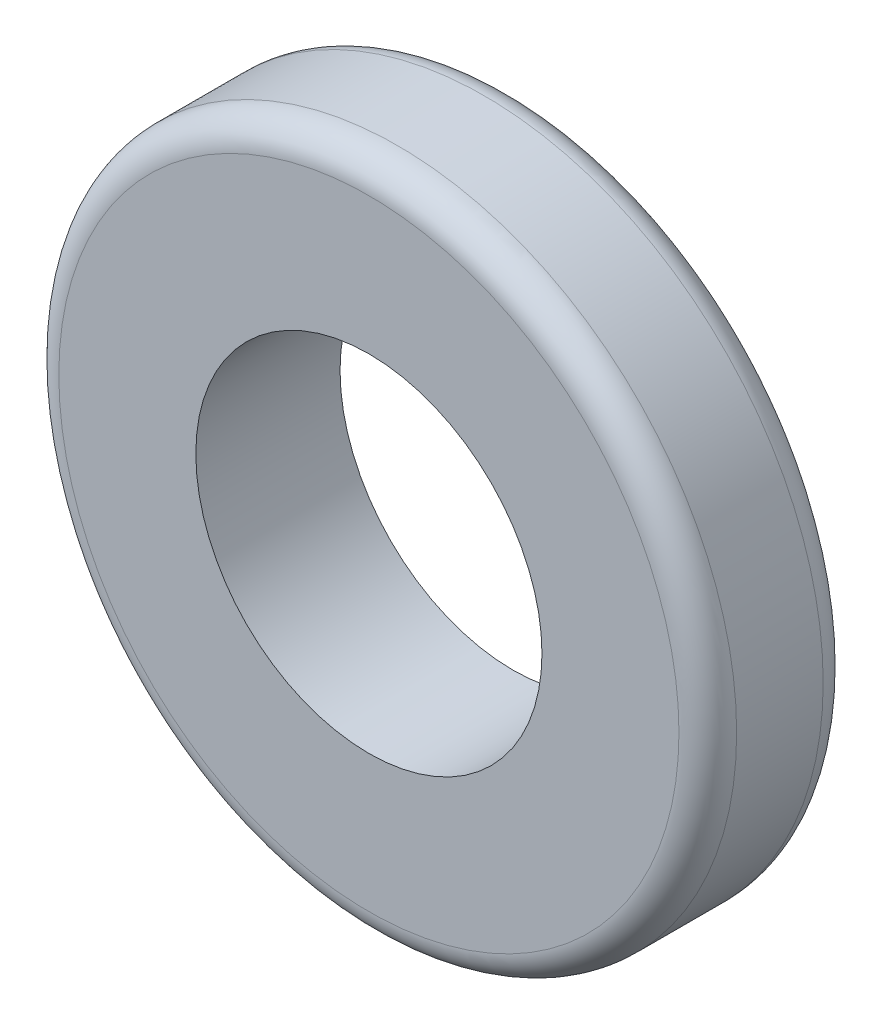
ISO-10303-21;
HEADER;
FILE_DESCRIPTION(('STEP AP214'),'2;1');
FILE_NAME('part.step','',(''),(''),'','','');
FILE_SCHEMA(('AUTOMOTIVE_DESIGN { 1 0 10303 214 1 1 1 1 }'));
ENDSEC;
DATA;
#1=APPLICATION_CONTEXT('core data for automotive mechanical design processes');
#2=APPLICATION_PROTOCOL_DEFINITION('international standard','automotive_design',2000,#1);
#3=PRODUCT_CONTEXT('',#1,'mechanical');
#4=PRODUCT('Part','Part','',(#3));
#5=PRODUCT_RELATED_PRODUCT_CATEGORY('part','',(#4));
#6=PRODUCT_DEFINITION_FORMATION('','',#4);
#7=PRODUCT_DEFINITION_CONTEXT('part definition',#1,'design');
#8=PRODUCT_DEFINITION('design','',#6,#7);
#9=PRODUCT_DEFINITION_SHAPE('','',#8);
#10=(LENGTH_UNIT() NAMED_UNIT(*) SI_UNIT(.MILLI.,.METRE.));
#11=(NAMED_UNIT(*) PLANE_ANGLE_UNIT() SI_UNIT($,.RADIAN.));
#12=(NAMED_UNIT(*) SI_UNIT($,.STERADIAN.) SOLID_ANGLE_UNIT());
#13=UNCERTAINTY_MEASURE_WITH_UNIT(LENGTH_MEASURE(1.E-05),#10,'distance_accuracy_value','');
#14=(GEOMETRIC_REPRESENTATION_CONTEXT(3) GLOBAL_UNCERTAINTY_ASSIGNED_CONTEXT((#13)) GLOBAL_UNIT_ASSIGNED_CONTEXT((#10,
#11,#12)) REPRESENTATION_CONTEXT('',''));
#15=CARTESIAN_POINT('',(0.,0.,0.));
#16=DIRECTION('',(0.,0.,1.));
#17=DIRECTION('',(1.,0.,0.));
#18=AXIS2_PLACEMENT_3D('',#15,#16,#17);
#19=CARTESIAN_POINT('',(0.,0.,10.));
#20=DIRECTION('',(0.,0.,1.));
#21=DIRECTION('',(1.,0.,0.));
#22=AXIS2_PLACEMENT_3D('',#19,#20,#21);
#23=PLANE('',#22);
#24=CARTESIAN_POINT('',(0.,0.,10.));
#25=DIRECTION('',(0.,0.,1.));
#26=DIRECTION('',(1.,0.,0.));
#27=AXIS2_PLACEMENT_3D('',#24,#25,#26);
#28=CIRCLE('',#27,21.5);
#29=CARTESIAN_POINT('',(21.5,0.,10.));
#30=VERTEX_POINT('',#29);
#31=EDGE_CURVE('E10',#30,#30,#28,.T.);
#32=ORIENTED_EDGE('',*,*,#31,.T.);
#33=EDGE_LOOP('',(#32));
#34=FACE_BOUND('',#33,.T.);
#35=CARTESIAN_POINT('',(0.,0.,10.));
#36=DIRECTION('',(0.,0.,1.));
#37=DIRECTION('',(1.,0.,0.));
#38=AXIS2_PLACEMENT_3D('',#35,#36,#37);
#39=CIRCLE('',#38,12.);
#40=CARTESIAN_POINT('',(12.,0.,10.));
#41=VERTEX_POINT('',#40);
#42=EDGE_CURVE('E51',#41,#41,#39,.T.);
#43=ORIENTED_EDGE('',*,*,#42,.F.);
#44=EDGE_LOOP('',(#43));
#45=FACE_BOUND('',#44,.T.);
#46=ADVANCED_FACE('F31',(#34,#45),#23,.T.);
#47=CARTESIAN_POINT('',(0.,0.,0.));
#48=DIRECTION('',(0.,0.,1.));
#49=DIRECTION('',(1.,0.,0.));
#50=AXIS2_PLACEMENT_3D('',#47,#48,#49);
#51=PLANE('',#50);
#52=CARTESIAN_POINT('',(0.,0.,0.));
#53=DIRECTION('',(0.,0.,1.));
#54=DIRECTION('',(1.,0.,0.));
#55=AXIS2_PLACEMENT_3D('',#52,#53,#54);
#56=CIRCLE('',#55,21.5);
#57=CARTESIAN_POINT('',(21.5,0.,0.));
#58=VERTEX_POINT('',#57);
#59=EDGE_CURVE('E38',#58,#58,#56,.F.);
#60=ORIENTED_EDGE('',*,*,#59,.T.);
#61=EDGE_LOOP('',(#60));
#62=FACE_BOUND('',#61,.T.);
#63=CARTESIAN_POINT('',(0.,0.,0.));
#64=DIRECTION('',(0.,0.,1.));
#65=DIRECTION('',(1.,0.,0.));
#66=AXIS2_PLACEMENT_3D('',#63,#64,#65);
#67=CIRCLE('',#66,12.);
#68=CARTESIAN_POINT('',(12.,0.,0.));
#69=VERTEX_POINT('',#68);
#70=EDGE_CURVE('E52',#69,#69,#67,.T.);
#71=ORIENTED_EDGE('',*,*,#70,.T.);
#72=EDGE_LOOP('',(#71));
#73=FACE_BOUND('',#72,.T.);
#74=ADVANCED_FACE('F62',(#62,#73),#51,.F.);
#75=CARTESIAN_POINT('',(0.,0.,10.));
#76=DIRECTION('',(0.,0.,-1.));
#77=DIRECTION('',(-1.,0.,0.));
#78=AXIS2_PLACEMENT_3D('',#75,#76,#77);
#79=CYLINDRICAL_SURFACE('',#78,23.5);
#80=CARTESIAN_POINT('',(0.,0.,2.));
#81=DIRECTION('',(0.,0.,1.));
#82=DIRECTION('',(1.,0.,0.));
#83=AXIS2_PLACEMENT_3D('',#80,#81,#82);
#84=CIRCLE('',#83,23.5);
#85=CARTESIAN_POINT('',(23.5,0.,2.));
#86=VERTEX_POINT('',#85);
#87=EDGE_CURVE('E42',#86,#86,#84,.T.);
#88=ORIENTED_EDGE('',*,*,#87,.T.);
#89=EDGE_LOOP('',(#88));
#90=FACE_BOUND('',#89,.T.);
#91=CARTESIAN_POINT('',(0.,0.,8.));
#92=DIRECTION('',(0.,0.,1.));
#93=DIRECTION('',(1.,0.,0.));
#94=AXIS2_PLACEMENT_3D('',#91,#92,#93);
#95=CIRCLE('',#94,23.5);
#96=CARTESIAN_POINT('',(23.5,0.,8.));
#97=VERTEX_POINT('',#96);
#98=EDGE_CURVE('E46',#97,#97,#95,.F.);
#99=ORIENTED_EDGE('',*,*,#98,.T.);
#100=EDGE_LOOP('',(#99));
#101=FACE_BOUND('',#100,.T.);
#102=ADVANCED_FACE('F67',(#90,#101),#79,.T.);
#103=CARTESIAN_POINT('',(0.,0.,10.));
#104=DIRECTION('',(0.,0.,-1.));
#105=DIRECTION('',(-1.,0.,0.));
#106=AXIS2_PLACEMENT_3D('',#103,#104,#105);
#107=CYLINDRICAL_SURFACE('',#106,12.);
#108=ORIENTED_EDGE('',*,*,#42,.T.);
#109=EDGE_LOOP('',(#108));
#110=FACE_BOUND('',#109,.T.);
#111=ORIENTED_EDGE('',*,*,#70,.F.);
#112=EDGE_LOOP('',(#111));
#113=FACE_BOUND('',#112,.T.);
#114=ADVANCED_FACE('F58',(#110,#113),#107,.F.);
#115=CARTESIAN_POINT('',(0.,0.,2.));
#116=DIRECTION('',(0.,0.,1.));
#117=DIRECTION('',(1.,0.,0.));
#118=AXIS2_PLACEMENT_3D('',#115,#116,#117);
#119=TOROIDAL_SURFACE('',#118,21.5,2.);
#120=ORIENTED_EDGE('',*,*,#59,.F.);
#121=EDGE_LOOP('',(#120));
#122=FACE_BOUND('',#121,.T.);
#123=ORIENTED_EDGE('',*,*,#87,.F.);
#124=EDGE_LOOP('',(#123));
#125=FACE_BOUND('',#124,.T.);
#126=ADVANCED_FACE('F73',(#122,#125),#119,.T.);
#127=CARTESIAN_POINT('',(0.,0.,8.));
#128=DIRECTION('',(0.,0.,1.));
#129=DIRECTION('',(1.,0.,0.));
#130=AXIS2_PLACEMENT_3D('',#127,#128,#129);
#131=TOROIDAL_SURFACE('',#130,21.5,2.);
#132=ORIENTED_EDGE('',*,*,#98,.F.);
#133=EDGE_LOOP('',(#132));
#134=FACE_BOUND('',#133,.T.);
#135=ORIENTED_EDGE('',*,*,#31,.F.);
#136=EDGE_LOOP('',(#135));
#137=FACE_BOUND('',#136,.T.);
#138=ADVANCED_FACE('F33',(#134,#137),#131,.T.);
#139=CLOSED_SHELL('',(#46,#74,#102,#114,#126,#138));
#140=MANIFOLD_SOLID_BREP('B2',#139);
#141=ADVANCED_BREP_SHAPE_REPRESENTATION('',(#18,#140),#14);
#142=SHAPE_DEFINITION_REPRESENTATION(#9,#141);
ENDSEC;
END-ISO-10303-21;
